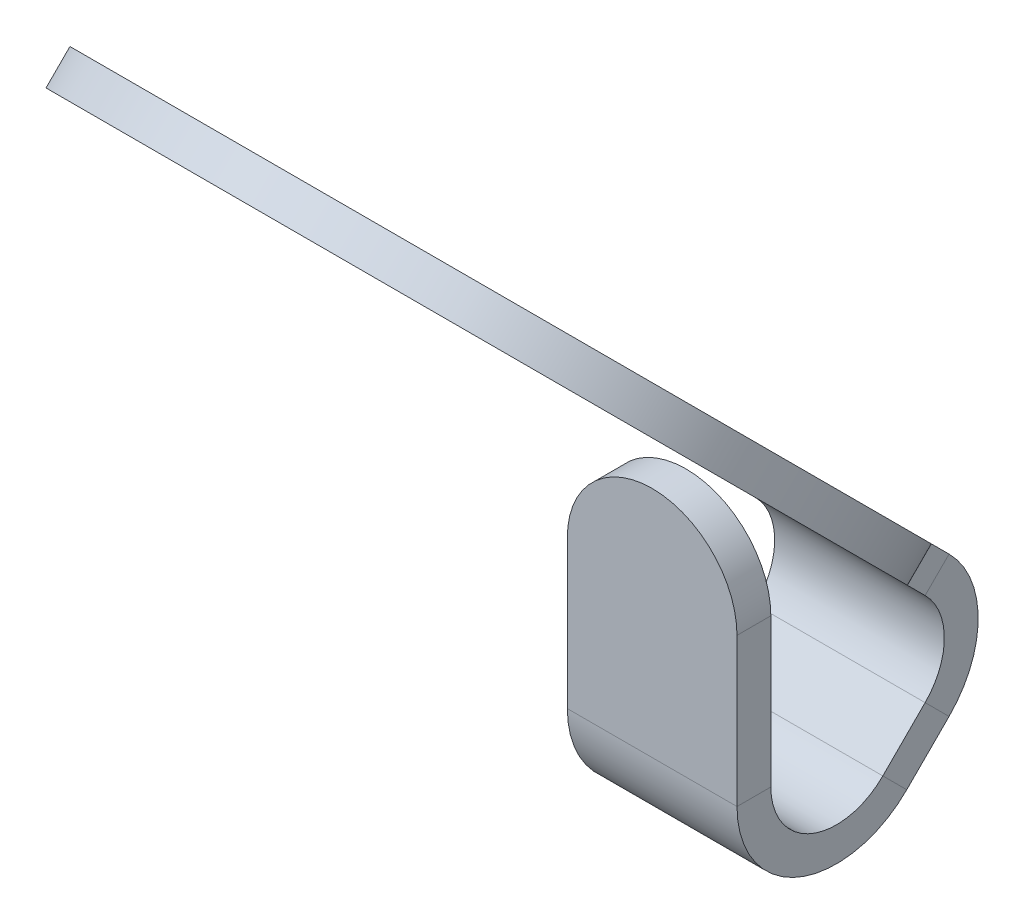
ISO-10303-21;
HEADER;
FILE_DESCRIPTION(('STEP AP214'),'2;1');
FILE_NAME('part.step','',(''),(''),'','','');
FILE_SCHEMA(('AUTOMOTIVE_DESIGN { 1 0 10303 214 1 1 1 1 }'));
ENDSEC;
DATA;
#1=APPLICATION_CONTEXT('core data for automotive mechanical design processes');
#2=APPLICATION_PROTOCOL_DEFINITION('international standard','automotive_design',2000,#1);
#3=PRODUCT_CONTEXT('',#1,'mechanical');
#4=PRODUCT('Part','Part','',(#3));
#5=PRODUCT_RELATED_PRODUCT_CATEGORY('part','',(#4));
#6=PRODUCT_DEFINITION_FORMATION('','',#4);
#7=PRODUCT_DEFINITION_CONTEXT('part definition',#1,'design');
#8=PRODUCT_DEFINITION('design','',#6,#7);
#9=PRODUCT_DEFINITION_SHAPE('','',#8);
#10=(LENGTH_UNIT() NAMED_UNIT(*) SI_UNIT(.MILLI.,.METRE.));
#11=(NAMED_UNIT(*) PLANE_ANGLE_UNIT() SI_UNIT($,.RADIAN.));
#12=(NAMED_UNIT(*) SI_UNIT($,.STERADIAN.) SOLID_ANGLE_UNIT());
#13=UNCERTAINTY_MEASURE_WITH_UNIT(LENGTH_MEASURE(1.E-05),#10,'distance_accuracy_value','');
#14=(GEOMETRIC_REPRESENTATION_CONTEXT(3) GLOBAL_UNCERTAINTY_ASSIGNED_CONTEXT((#13)) GLOBAL_UNIT_ASSIGNED_CONTEXT((#10,
#11,#12)) REPRESENTATION_CONTEXT('',''));
#15=CARTESIAN_POINT('',(0.,0.,0.));
#16=DIRECTION('',(0.,0.,1.));
#17=DIRECTION('',(1.,0.,0.));
#18=AXIS2_PLACEMENT_3D('',#15,#16,#17);
#19=CARTESIAN_POINT('',(0.9525,5.67722747838223,2.10753662697403));
#20=DIRECTION('',(1.,0.,0.));
#21=DIRECTION('',(0.,0.707106781186549,-0.707106781186546));
#22=AXIS2_PLACEMENT_3D('',#19,#20,#21);
#23=PLANE('',#22);
#24=DIRECTION('',(0.,0.707106781186549,-0.707106781186546));
#25=VECTOR('',#24,1.);
#26=CARTESIAN_POINT('',(0.9525,5.94592805523312,2.37623720382492));
#27=LINE('',#26,#25);
#28=CARTESIAN_POINT('',(0.952500000000001,3.07077005228413,5.2513952067739));
#29=VERTEX_POINT('',#28);
#30=CARTESIAN_POINT('',(0.9525,3.54578677576021,4.77637848329782));
#31=VERTEX_POINT('',#30);
#32=EDGE_CURVE('E164',#29,#31,#27,.T.);
#33=ORIENTED_EDGE('',*,*,#32,.F.);
#34=DIRECTION('',(0.,-0.707106781186544,-0.707106781186551));
#35=VECTOR('',#34,1.);
#36=CARTESIAN_POINT('',(0.952500000000001,2.80206947543323,4.982694629923));
#37=LINE('',#36,#35);
#38=CARTESIAN_POINT('',(0.952500000000001,2.80206947543324,4.98269462992301));
#39=VERTEX_POINT('',#38);
#40=EDGE_CURVE('E147',#29,#39,#37,.T.);
#41=ORIENTED_EDGE('',*,*,#40,.T.);
#42=DIRECTION('',(0.,0.707106781186549,-0.707106781186546));
#43=VECTOR('',#42,1.);
#44=CARTESIAN_POINT('',(0.9525,5.67722747838223,2.10753662697403));
#45=LINE('',#44,#43);
#46=CARTESIAN_POINT('',(0.952500000000001,3.27708619890932,4.50767790644693));
#47=VERTEX_POINT('',#46);
#48=EDGE_CURVE('E52',#39,#47,#45,.T.);
#49=ORIENTED_EDGE('',*,*,#48,.T.);
#50=DIRECTION('',(0.,0.707106781186546,0.707106781186549));
#51=VECTOR('',#50,1.);
#52=CARTESIAN_POINT('',(0.952500000000001,3.27708619890932,4.50767790644693));
#53=LINE('',#52,#51);
#54=EDGE_CURVE('E148',#47,#31,#53,.T.);
#55=ORIENTED_EDGE('',*,*,#54,.T.);
#56=EDGE_LOOP('',(#33,#41,#49,#55));
#57=FACE_BOUND('',#56,.T.);
#58=ADVANCED_FACE('F48',(#57),#23,.T.);
#59=CARTESIAN_POINT('',(-0.9525,5.67722747838223,2.10753662697403));
#60=DIRECTION('',(-1.,0.,0.));
#61=DIRECTION('',(0.,-0.707106781186549,0.707106781186546));
#62=AXIS2_PLACEMENT_3D('',#59,#60,#61);
#63=PLANE('',#62);
#64=DIRECTION('',(0.,-0.707106781186549,0.707106781186546));
#65=VECTOR('',#64,1.);
#66=CARTESIAN_POINT('',(-0.9525,5.67722747838223,2.10753662697403));
#67=LINE('',#66,#65);
#68=CARTESIAN_POINT('',(-0.952499999999999,3.27708619890932,4.50767790644693));
#69=VERTEX_POINT('',#68);
#70=CARTESIAN_POINT('',(-0.952499999999999,2.80206947543324,4.98269462992301));
#71=VERTEX_POINT('',#70);
#72=EDGE_CURVE('E162',#69,#71,#67,.T.);
#73=ORIENTED_EDGE('',*,*,#72,.T.);
#74=DIRECTION('',(0.,0.707106781186544,0.707106781186551));
#75=VECTOR('',#74,1.);
#76=CARTESIAN_POINT('',(-0.952499999999999,2.80206947543323,4.982694629923));
#77=LINE('',#76,#75);
#78=CARTESIAN_POINT('',(-0.952499999999999,3.07077005228413,5.2513952067739));
#79=VERTEX_POINT('',#78);
#80=EDGE_CURVE('E12',#71,#79,#77,.T.);
#81=ORIENTED_EDGE('',*,*,#80,.T.);
#82=DIRECTION('',(0.,-0.707106781186549,0.707106781186546));
#83=VECTOR('',#82,1.);
#84=CARTESIAN_POINT('',(-0.9525,5.94592805523312,2.37623720382492));
#85=LINE('',#84,#83);
#86=CARTESIAN_POINT('',(-0.952499999999999,3.54578677576021,4.77637848329782));
#87=VERTEX_POINT('',#86);
#88=EDGE_CURVE('E171',#87,#79,#85,.T.);
#89=ORIENTED_EDGE('',*,*,#88,.F.);
#90=DIRECTION('',(0.,-0.707106781186546,-0.707106781186549));
#91=VECTOR('',#90,1.);
#92=CARTESIAN_POINT('',(-0.9525,3.27708619890932,4.50767790644693));
#93=LINE('',#92,#91);
#94=EDGE_CURVE('E189',#87,#69,#93,.T.);
#95=ORIENTED_EDGE('',*,*,#94,.T.);
#96=EDGE_LOOP('',(#73,#81,#89,#95));
#97=FACE_BOUND('',#96,.T.);
#98=ADVANCED_FACE('F50',(#97),#63,.T.);
#99=CARTESIAN_POINT('',(0.,8.38787719293408,-0.603113087577814));
#100=DIRECTION('',(0.,-0.707106781186546,-0.707106781186549));
#101=DIRECTION('',(0.,0.707106781186549,-0.707106781186546));
#102=AXIS2_PLACEMENT_3D('',#99,#100,#101);
#103=PLANE('',#102);
#104=ORIENTED_EDGE('',*,*,#48,.F.);
#105=DIRECTION('',(-1.,0.,0.));
#106=VECTOR('',#105,1.);
#107=CARTESIAN_POINT('',(0.,2.80206947543324,4.98269462992301));
#108=LINE('',#107,#106);
#109=EDGE_CURVE('E140',#39,#71,#108,.T.);
#110=ORIENTED_EDGE('',*,*,#109,.T.);
#111=ORIENTED_EDGE('',*,*,#72,.F.);
#112=DIRECTION('',(1.,0.,0.));
#113=VECTOR('',#112,1.);
#114=CARTESIAN_POINT('',(0.,3.27708619890932,4.50767790644693));
#115=LINE('',#114,#113);
#116=EDGE_CURVE('E161',#69,#47,#115,.T.);
#117=ORIENTED_EDGE('',*,*,#116,.T.);
#118=EDGE_LOOP('',(#104,#110,#111,#117));
#119=FACE_BOUND('',#118,.T.);
#120=ADVANCED_FACE('F160',(#119),#103,.T.);
#121=CARTESIAN_POINT('',(0.,8.65657776978497,-0.334412510726924));
#122=DIRECTION('',(0.,-0.707106781186546,-0.707106781186549));
#123=DIRECTION('',(0.,0.707106781186549,-0.707106781186546));
#124=AXIS2_PLACEMENT_3D('',#121,#122,#123);
#125=PLANE('',#124);
#126=DIRECTION('',(-1.,0.,0.));
#127=VECTOR('',#126,1.);
#128=CARTESIAN_POINT('',(0.,3.07077005228412,5.2513952067739));
#129=LINE('',#128,#127);
#130=EDGE_CURVE('E57',#29,#79,#129,.T.);
#131=ORIENTED_EDGE('',*,*,#130,.F.);
#132=ORIENTED_EDGE('',*,*,#32,.T.);
#133=DIRECTION('',(1.,0.,0.));
#134=VECTOR('',#133,1.);
#135=CARTESIAN_POINT('',(0.,3.54578677576021,4.77637848329782));
#136=LINE('',#135,#134);
#137=EDGE_CURVE('E178',#87,#31,#136,.T.);
#138=ORIENTED_EDGE('',*,*,#137,.F.);
#139=ORIENTED_EDGE('',*,*,#88,.T.);
#140=EDGE_LOOP('',(#131,#132,#138,#139));
#141=FACE_BOUND('',#140,.T.);
#142=ADVANCED_FACE('F177',(#141),#125,.F.);
#143=CARTESIAN_POINT('',(0.,8.93779422405546,8.58927506784732));
#144=DIRECTION('',(0.,-0.707106781186551,0.707106781186544));
#145=DIRECTION('',(0.,-0.707106781186544,-0.707106781186551));
#146=AXIS2_PLACEMENT_3D('',#143,#144,#145);
#147=CYLINDRICAL_SURFACE('',#146,1.65);
#148=CARTESIAN_POINT('',(0.,8.93779422405546,8.58927506784732));
#149=DIRECTION('',(0.,-0.707106781186551,0.707106781186544));
#150=DIRECTION('',(0.,-0.707106781186544,-0.707106781186551));
#151=AXIS2_PLACEMENT_3D('',#148,#149,#150);
#152=CIRCLE('',#151,1.65);
#153=CARTESIAN_POINT('',(0.,7.77106803509766,7.42254887888951));
#154=VERTEX_POINT('',#153);
#155=EDGE_CURVE('E220',#154,#154,#152,.T.);
#156=ORIENTED_EDGE('',*,*,#155,.F.);
#157=EDGE_LOOP('',(#156));
#158=FACE_BOUND('',#157,.T.);
#159=CARTESIAN_POINT('',(0.,8.66909364720457,8.85797564469821));
#160=DIRECTION('',(0.,-0.707106781186551,0.707106781186544));
#161=DIRECTION('',(0.,-0.707106781186544,-0.707106781186551));
#162=AXIS2_PLACEMENT_3D('',#159,#160,#161);
#163=CIRCLE('',#162,1.65);
#164=CARTESIAN_POINT('',(0.,7.50236745824678,7.6912494557404));
#165=VERTEX_POINT('',#164);
#166=EDGE_CURVE('E212',#165,#165,#163,.T.);
#167=ORIENTED_EDGE('',*,*,#166,.T.);
#168=EDGE_LOOP('',(#167));
#169=FACE_BOUND('',#168,.T.);
#170=ADVANCED_FACE('F315',(#158,#169),#147,.F.);
#171=CARTESIAN_POINT('',(0.,8.93779422405546,8.58927506784732));
#172=DIRECTION('',(0.,-0.707106781186551,0.707106781186544));
#173=DIRECTION('',(0.,-0.707106781186544,-0.707106781186551));
#174=AXIS2_PLACEMENT_3D('',#171,#172,#173);
#175=CYLINDRICAL_SURFACE('',#174,3.95);
#176=CARTESIAN_POINT('',(0.,8.66909364720457,8.85797564469821));
#177=DIRECTION('',(0.,-0.707106781186551,0.707106781186544));
#178=DIRECTION('',(0.,0.707106781186544,0.707106781186551));
#179=AXIS2_PLACEMENT_3D('',#176,#177,#178);
#180=CIRCLE('',#179,3.95);
#181=CARTESIAN_POINT('',(0.9525,5.95844393265274,6.14732593014635));
#182=VERTEX_POINT('',#181);
#183=CARTESIAN_POINT('',(-0.9525,5.95844393265274,6.14732593014635));
#184=VERTEX_POINT('',#183);
#185=EDGE_CURVE('E232',#182,#184,#180,.T.);
#186=ORIENTED_EDGE('',*,*,#185,.F.);
#187=DIRECTION('',(0.,-0.707106781186551,0.707106781186544));
#188=VECTOR('',#187,1.);
#189=CARTESIAN_POINT('',(0.9525,6.22714450950363,5.87862535329546));
#190=LINE('',#189,#188);
#191=CARTESIAN_POINT('',(0.9525,6.22714450950363,5.87862535329546));
#192=VERTEX_POINT('',#191);
#193=EDGE_CURVE('E173',#192,#182,#190,.T.);
#194=ORIENTED_EDGE('',*,*,#193,.F.);
#195=CARTESIAN_POINT('',(0.,8.93779422405546,8.58927506784732));
#196=DIRECTION('',(0.,-0.707106781186551,0.707106781186544));
#197=DIRECTION('',(0.,0.707106781186544,0.707106781186551));
#198=AXIS2_PLACEMENT_3D('',#195,#196,#197);
#199=CIRCLE('',#198,3.95);
#200=CARTESIAN_POINT('',(-0.9525,6.22714450950363,5.87862535329546));
#201=VERTEX_POINT('',#200);
#202=EDGE_CURVE('E215',#192,#201,#199,.T.);
#203=ORIENTED_EDGE('',*,*,#202,.T.);
#204=DIRECTION('',(0.,-0.707106781186551,0.707106781186544));
#205=VECTOR('',#204,1.);
#206=CARTESIAN_POINT('',(-0.9525,6.22714450950363,5.87862535329546));
#207=LINE('',#206,#205);
#208=EDGE_CURVE('E218',#201,#184,#207,.T.);
#209=ORIENTED_EDGE('',*,*,#208,.T.);
#210=EDGE_LOOP('',(#186,#194,#203,#209));
#211=FACE_BOUND('',#210,.T.);
#212=ADVANCED_FACE('F320',(#211),#175,.T.);
#213=CARTESIAN_POINT('',(0.,8.93779422405546,8.58927506784732));
#214=DIRECTION('',(0.,0.707106781186551,-0.707106781186544));
#215=DIRECTION('',(0.,0.707106781186544,0.707106781186551));
#216=AXIS2_PLACEMENT_3D('',#213,#214,#215);
#217=PLANE('',#216);
#218=DIRECTION('',(1.,0.,0.));
#219=VECTOR('',#218,1.);
#220=CARTESIAN_POINT('',(0.,4.85619706265512,4.50767790644694));
#221=LINE('',#220,#219);
#222=CARTESIAN_POINT('',(-0.9525,4.85619706265512,4.50767790644694));
#223=VERTEX_POINT('',#222);
#224=CARTESIAN_POINT('',(0.9525,4.85619706265512,4.50767790644694));
#225=VERTEX_POINT('',#224);
#226=EDGE_CURVE('E204',#223,#225,#221,.T.);
#227=ORIENTED_EDGE('',*,*,#226,.F.);
#228=DIRECTION('',(0.,-0.707106781186544,-0.707106781186551));
#229=VECTOR('',#228,1.);
#230=CARTESIAN_POINT('',(-0.9525,6.22714450950363,5.87862535329546));
#231=LINE('',#230,#229);
#232=EDGE_CURVE('E223',#201,#223,#231,.T.);
#233=ORIENTED_EDGE('',*,*,#232,.F.);
#234=ORIENTED_EDGE('',*,*,#202,.F.);
#235=DIRECTION('',(0.,0.707106781186544,0.707106781186551));
#236=VECTOR('',#235,1.);
#237=CARTESIAN_POINT('',(0.9525,6.22714450950363,5.87862535329546));
#238=LINE('',#237,#236);
#239=EDGE_CURVE('E235',#225,#192,#238,.T.);
#240=ORIENTED_EDGE('',*,*,#239,.F.);
#241=EDGE_LOOP('',(#227,#233,#234,#240));
#242=FACE_BOUND('',#241,.T.);
#243=ORIENTED_EDGE('',*,*,#155,.T.);
#244=EDGE_LOOP('',(#243));
#245=FACE_BOUND('',#244,.T.);
#246=ADVANCED_FACE('F445',(#242,#245),#217,.T.);
#247=CARTESIAN_POINT('',(-0.9525,6.22714450950363,5.87862535329546));
#248=DIRECTION('',(-1.,0.,0.));
#249=DIRECTION('',(0.,-0.707106781186544,-0.707106781186551));
#250=AXIS2_PLACEMENT_3D('',#247,#248,#249);
#251=PLANE('',#250);
#252=DIRECTION('',(0.,0.707106781186551,-0.707106781186544));
#253=VECTOR('',#252,1.);
#254=CARTESIAN_POINT('',(-0.9525,4.85619706265512,4.50767790644694));
#255=LINE('',#254,#253);
#256=CARTESIAN_POINT('',(-0.9525,4.58749648580423,4.77637848329782));
#257=VERTEX_POINT('',#256);
#258=EDGE_CURVE('E209',#257,#223,#255,.T.);
#259=ORIENTED_EDGE('',*,*,#258,.F.);
#260=DIRECTION('',(0.,-0.707106781186544,-0.707106781186551));
#261=VECTOR('',#260,1.);
#262=CARTESIAN_POINT('',(-0.9525,5.95844393265274,6.14732593014635));
#263=LINE('',#262,#261);
#264=EDGE_CURVE('E225',#184,#257,#263,.T.);
#265=ORIENTED_EDGE('',*,*,#264,.F.);
#266=ORIENTED_EDGE('',*,*,#208,.F.);
#267=ORIENTED_EDGE('',*,*,#232,.T.);
#268=EDGE_LOOP('',(#259,#265,#266,#267));
#269=FACE_BOUND('',#268,.T.);
#270=ADVANCED_FACE('F456',(#269),#251,.T.);
#271=CARTESIAN_POINT('',(0.,8.66909364720457,8.85797564469821));
#272=DIRECTION('',(0.,0.707106781186551,-0.707106781186544));
#273=DIRECTION('',(0.,0.707106781186544,0.707106781186551));
#274=AXIS2_PLACEMENT_3D('',#271,#272,#273);
#275=PLANE('',#274);
#276=ORIENTED_EDGE('',*,*,#166,.F.);
#277=EDGE_LOOP('',(#276));
#278=FACE_BOUND('',#277,.T.);
#279=ORIENTED_EDGE('',*,*,#264,.T.);
#280=DIRECTION('',(1.,0.,0.));
#281=VECTOR('',#280,1.);
#282=CARTESIAN_POINT('',(0.,4.58749648580423,4.77637848329782));
#283=LINE('',#282,#281);
#284=CARTESIAN_POINT('',(0.9525,4.58749648580423,4.77637848329782));
#285=VERTEX_POINT('',#284);
#286=EDGE_CURVE('E227',#257,#285,#283,.T.);
#287=ORIENTED_EDGE('',*,*,#286,.T.);
#288=DIRECTION('',(0.,0.707106781186544,0.707106781186551));
#289=VECTOR('',#288,1.);
#290=CARTESIAN_POINT('',(0.9525,5.95844393265274,6.14732593014635));
#291=LINE('',#290,#289);
#292=EDGE_CURVE('E230',#285,#182,#291,.T.);
#293=ORIENTED_EDGE('',*,*,#292,.T.);
#294=ORIENTED_EDGE('',*,*,#185,.T.);
#295=EDGE_LOOP('',(#279,#287,#293,#294));
#296=FACE_BOUND('',#295,.T.);
#297=ADVANCED_FACE('F467',(#278,#296),#275,.F.);
#298=CARTESIAN_POINT('',(0.9525,6.22714450950363,5.87862535329546));
#299=DIRECTION('',(1.,0.,0.));
#300=DIRECTION('',(0.,0.707106781186544,0.707106781186551));
#301=AXIS2_PLACEMENT_3D('',#298,#299,#300);
#302=PLANE('',#301);
#303=DIRECTION('',(0.,-0.707106781186551,0.707106781186544));
#304=VECTOR('',#303,1.);
#305=CARTESIAN_POINT('',(0.9525,4.85619706265512,4.50767790644694));
#306=LINE('',#305,#304);
#307=EDGE_CURVE('E197',#225,#285,#306,.T.);
#308=ORIENTED_EDGE('',*,*,#307,.F.);
#309=ORIENTED_EDGE('',*,*,#239,.T.);
#310=ORIENTED_EDGE('',*,*,#193,.T.);
#311=ORIENTED_EDGE('',*,*,#292,.F.);
#312=EDGE_LOOP('',(#308,#309,#310,#311));
#313=FACE_BOUND('',#312,.T.);
#314=ADVANCED_FACE('F479',(#313),#302,.T.);
#315=CARTESIAN_POINT('',(-0.9525,4.06664163078222,5.29723333831983));
#316=DIRECTION('',(-1.,0.,0.));
#317=DIRECTION('',(0.,-0.707106781186544,-0.707106781186551));
#318=AXIS2_PLACEMENT_3D('',#315,#316,#317);
#319=PLANE('',#318);
#320=ORIENTED_EDGE('',*,*,#94,.F.);
#321=CARTESIAN_POINT('',(-0.952499999999999,4.06664163078222,5.29723333831983));
#322=DIRECTION('',(-1.,0.,0.));
#323=DIRECTION('',(0.,-0.707106781186544,-0.707106781186551));
#324=AXIS2_PLACEMENT_3D('',#321,#322,#323);
#325=CIRCLE('',#324,0.7366);
#326=EDGE_CURVE('E187',#87,#257,#325,.F.);
#327=ORIENTED_EDGE('',*,*,#326,.T.);
#328=ORIENTED_EDGE('',*,*,#258,.T.);
#329=CARTESIAN_POINT('',(-0.9525,4.06664163078222,5.29723333831983));
#330=DIRECTION('',(1.,0.,0.));
#331=DIRECTION('',(0.,-0.707106781186544,-0.707106781186551));
#332=AXIS2_PLACEMENT_3D('',#329,#330,#331);
#333=CIRCLE('',#332,1.1166);
#334=EDGE_CURVE('E198',#69,#223,#333,.T.);
#335=ORIENTED_EDGE('',*,*,#334,.F.);
#336=EDGE_LOOP('',(#320,#327,#328,#335));
#337=FACE_BOUND('',#336,.T.);
#338=ADVANCED_FACE('F489',(#337),#319,.T.);
#339=CARTESIAN_POINT('',(0.952500000000001,4.06664163078222,5.29723333831983));
#340=DIRECTION('',(1.,0.,0.));
#341=DIRECTION('',(0.,0.707106781186544,0.707106781186551));
#342=AXIS2_PLACEMENT_3D('',#339,#340,#341);
#343=PLANE('',#342);
#344=CARTESIAN_POINT('',(0.9525,4.06664163078222,5.29723333831983));
#345=DIRECTION('',(-1.,0.,0.));
#346=DIRECTION('',(0.,-0.707106781186544,-0.707106781186551));
#347=AXIS2_PLACEMENT_3D('',#344,#345,#346);
#348=CIRCLE('',#347,0.7366);
#349=EDGE_CURVE('E185',#285,#31,#348,.T.);
#350=ORIENTED_EDGE('',*,*,#349,.T.);
#351=ORIENTED_EDGE('',*,*,#54,.F.);
#352=CARTESIAN_POINT('',(0.952500000000001,4.06664163078222,5.29723333831983));
#353=DIRECTION('',(-1.,0.,0.));
#354=DIRECTION('',(0.,0.707106781186544,0.707106781186551));
#355=AXIS2_PLACEMENT_3D('',#352,#353,#354);
#356=CIRCLE('',#355,1.1166);
#357=EDGE_CURVE('E207',#225,#47,#356,.T.);
#358=ORIENTED_EDGE('',*,*,#357,.F.);
#359=ORIENTED_EDGE('',*,*,#307,.T.);
#360=EDGE_LOOP('',(#350,#351,#358,#359));
#361=FACE_BOUND('',#360,.T.);
#362=ADVANCED_FACE('F194',(#361),#343,.T.);
#363=CARTESIAN_POINT('',(2.42732463634845,4.06664163078222,5.29723333831983));
#364=DIRECTION('',(-1.,0.,0.));
#365=DIRECTION('',(0.,-0.707106781186544,-0.707106781186551));
#366=AXIS2_PLACEMENT_3D('',#363,#364,#365);
#367=CYLINDRICAL_SURFACE('',#366,1.1166);
#368=ORIENTED_EDGE('',*,*,#226,.T.);
#369=ORIENTED_EDGE('',*,*,#357,.T.);
#370=ORIENTED_EDGE('',*,*,#116,.F.);
#371=ORIENTED_EDGE('',*,*,#334,.T.);
#372=EDGE_LOOP('',(#368,#369,#370,#371));
#373=FACE_BOUND('',#372,.T.);
#374=ADVANCED_FACE('F508',(#373),#367,.T.);
#375=CARTESIAN_POINT('',(2.42732463634845,4.06664163078222,5.29723333831983));
#376=DIRECTION('',(-1.,0.,0.));
#377=DIRECTION('',(0.,-0.707106781186544,-0.707106781186551));
#378=AXIS2_PLACEMENT_3D('',#375,#376,#377);
#379=CYLINDRICAL_SURFACE('',#378,0.7366);
#380=ORIENTED_EDGE('',*,*,#286,.F.);
#381=ORIENTED_EDGE('',*,*,#326,.F.);
#382=ORIENTED_EDGE('',*,*,#137,.T.);
#383=ORIENTED_EDGE('',*,*,#349,.F.);
#384=EDGE_LOOP('',(#380,#381,#382,#383));
#385=FACE_BOUND('',#384,.T.);
#386=ADVANCED_FACE('F184',(#385),#379,.F.);
#387=CARTESIAN_POINT('',(0.,5.25635006179592,6.88885006179591));
#388=DIRECTION('',(0.,0.,-1.));
#389=DIRECTION('',(0.,1.,0.));
#390=AXIS2_PLACEMENT_3D('',#387,#388,#389);
#391=CYLINDRICAL_SURFACE('',#390,0.9525);
#392=CARTESIAN_POINT('',(0.,5.25635006179592,6.50885006179591));
#393=DIRECTION('',(0.,0.,-1.));
#394=DIRECTION('',(0.,-1.,0.));
#395=AXIS2_PLACEMENT_3D('',#392,#393,#394);
#396=CIRCLE('',#395,0.9525);
#397=CARTESIAN_POINT('',(-0.952499999999999,5.25635006179592,6.50885006179591));
#398=VERTEX_POINT('',#397);
#399=CARTESIAN_POINT('',(0.952500000000001,5.25635006179592,6.50885006179591));
#400=VERTEX_POINT('',#399);
#401=EDGE_CURVE('E264',#398,#400,#396,.T.);
#402=ORIENTED_EDGE('',*,*,#401,.F.);
#403=DIRECTION('',(0.,0.,-1.));
#404=VECTOR('',#403,1.);
#405=CARTESIAN_POINT('',(-0.952499999999999,5.25635006179592,6.88885006179591));
#406=LINE('',#405,#404);
#407=CARTESIAN_POINT('',(-0.952499999999999,5.25635006179592,6.88885006179591));
#408=VERTEX_POINT('',#407);
#409=EDGE_CURVE('E240',#408,#398,#406,.T.);
#410=ORIENTED_EDGE('',*,*,#409,.F.);
#411=CARTESIAN_POINT('',(0.,5.25635006179592,6.88885006179591));
#412=DIRECTION('',(0.,0.,-1.));
#413=DIRECTION('',(0.,-1.,0.));
#414=AXIS2_PLACEMENT_3D('',#411,#412,#413);
#415=CIRCLE('',#414,0.9525);
#416=CARTESIAN_POINT('',(0.952500000000001,5.25635006179592,6.88885006179591));
#417=VERTEX_POINT('',#416);
#418=EDGE_CURVE('E250',#408,#417,#415,.T.);
#419=ORIENTED_EDGE('',*,*,#418,.T.);
#420=DIRECTION('',(0.,0.,-1.));
#421=VECTOR('',#420,1.);
#422=CARTESIAN_POINT('',(0.952500000000001,5.25635006179592,6.88885006179591));
#423=LINE('',#422,#421);
#424=EDGE_CURVE('E253',#417,#400,#423,.T.);
#425=ORIENTED_EDGE('',*,*,#424,.T.);
#426=EDGE_LOOP('',(#402,#410,#419,#425));
#427=FACE_BOUND('',#426,.T.);
#428=ADVANCED_FACE('F295',(#427),#391,.T.);
#429=CARTESIAN_POINT('',(0.,-6.49114993820407,6.88885006179595));
#430=DIRECTION('',(0.,0.,1.));
#431=DIRECTION('',(0.,-1.,0.));
#432=AXIS2_PLACEMENT_3D('',#429,#430,#431);
#433=PLANE('',#432);
#434=DIRECTION('',(-1.,0.,0.));
#435=VECTOR('',#434,1.);
#436=CARTESIAN_POINT('',(0.,3.59162490730614,6.88885006179591));
#437=LINE('',#436,#435);
#438=CARTESIAN_POINT('',(0.952500000000001,3.59162490730614,6.88885006179591));
#439=VERTEX_POINT('',#438);
#440=CARTESIAN_POINT('',(-0.952499999999999,3.59162490730614,6.88885006179591));
#441=VERTEX_POINT('',#440);
#442=EDGE_CURVE('E244',#439,#441,#437,.T.);
#443=ORIENTED_EDGE('',*,*,#442,.F.);
#444=DIRECTION('',(0.,-1.,0.));
#445=VECTOR('',#444,1.);
#446=CARTESIAN_POINT('',(0.9525,-2.6577123490421,6.88885006179593));
#447=LINE('',#446,#445);
#448=EDGE_CURVE('E255',#417,#439,#447,.T.);
#449=ORIENTED_EDGE('',*,*,#448,.F.);
#450=ORIENTED_EDGE('',*,*,#418,.F.);
#451=DIRECTION('',(0.,1.,0.));
#452=VECTOR('',#451,1.);
#453=CARTESIAN_POINT('',(-0.9525,-2.6577123490421,6.88885006179593));
#454=LINE('',#453,#452);
#455=EDGE_CURVE('E267',#441,#408,#454,.T.);
#456=ORIENTED_EDGE('',*,*,#455,.F.);
#457=EDGE_LOOP('',(#443,#449,#450,#456));
#458=FACE_BOUND('',#457,.T.);
#459=ADVANCED_FACE('F291',(#458),#433,.T.);
#460=CARTESIAN_POINT('',(0.9525,-2.6577123490421,6.88885006179593));
#461=DIRECTION('',(1.,0.,0.));
#462=DIRECTION('',(0.,-1.,0.));
#463=AXIS2_PLACEMENT_3D('',#460,#461,#462);
#464=PLANE('',#463);
#465=DIRECTION('',(0.,0.,1.));
#466=VECTOR('',#465,1.);
#467=CARTESIAN_POINT('',(0.952500000000001,3.59162490730614,6.88885006179593));
#468=LINE('',#467,#466);
#469=CARTESIAN_POINT('',(0.952500000000001,3.59162490730614,6.50885006179591));
#470=VERTEX_POINT('',#469);
#471=EDGE_CURVE('E156',#470,#439,#468,.T.);
#472=ORIENTED_EDGE('',*,*,#471,.F.);
#473=DIRECTION('',(0.,-1.,0.));
#474=VECTOR('',#473,1.);
#475=CARTESIAN_POINT('',(0.9525,-2.6577123490421,6.50885006179593));
#476=LINE('',#475,#474);
#477=EDGE_CURVE('E257',#400,#470,#476,.T.);
#478=ORIENTED_EDGE('',*,*,#477,.F.);
#479=ORIENTED_EDGE('',*,*,#424,.F.);
#480=ORIENTED_EDGE('',*,*,#448,.T.);
#481=EDGE_LOOP('',(#472,#478,#479,#480));
#482=FACE_BOUND('',#481,.T.);
#483=ADVANCED_FACE('F297',(#482),#464,.T.);
#484=CARTESIAN_POINT('',(0.,-6.49114993820408,6.50885006179595));
#485=DIRECTION('',(0.,0.,1.));
#486=DIRECTION('',(0.,-1.,0.));
#487=AXIS2_PLACEMENT_3D('',#484,#485,#486);
#488=PLANE('',#487);
#489=ORIENTED_EDGE('',*,*,#477,.T.);
#490=DIRECTION('',(-1.,0.,0.));
#491=VECTOR('',#490,1.);
#492=CARTESIAN_POINT('',(0.,3.59162490730614,6.50885006179591));
#493=LINE('',#492,#491);
#494=CARTESIAN_POINT('',(-0.952499999999999,3.59162490730614,6.50885006179591));
#495=VERTEX_POINT('',#494);
#496=EDGE_CURVE('E259',#470,#495,#493,.T.);
#497=ORIENTED_EDGE('',*,*,#496,.T.);
#498=DIRECTION('',(0.,1.,0.));
#499=VECTOR('',#498,1.);
#500=CARTESIAN_POINT('',(-0.9525,-2.6577123490421,6.50885006179593));
#501=LINE('',#500,#499);
#502=EDGE_CURVE('E262',#495,#398,#501,.T.);
#503=ORIENTED_EDGE('',*,*,#502,.T.);
#504=ORIENTED_EDGE('',*,*,#401,.T.);
#505=EDGE_LOOP('',(#489,#497,#503,#504));
#506=FACE_BOUND('',#505,.T.);
#507=ADVANCED_FACE('F280',(#506),#488,.F.);
#508=CARTESIAN_POINT('',(-0.9525,-2.6577123490421,6.88885006179593));
#509=DIRECTION('',(-1.,0.,0.));
#510=DIRECTION('',(0.,1.,0.));
#511=AXIS2_PLACEMENT_3D('',#508,#509,#510);
#512=PLANE('',#511);
#513=DIRECTION('',(0.,0.,-1.));
#514=VECTOR('',#513,1.);
#515=CARTESIAN_POINT('',(-0.952499999999999,3.59162490730614,6.88885006179593));
#516=LINE('',#515,#514);
#517=EDGE_CURVE('E246',#441,#495,#516,.T.);
#518=ORIENTED_EDGE('',*,*,#517,.F.);
#519=ORIENTED_EDGE('',*,*,#455,.T.);
#520=ORIENTED_EDGE('',*,*,#409,.T.);
#521=ORIENTED_EDGE('',*,*,#502,.F.);
#522=EDGE_LOOP('',(#518,#519,#520,#521));
#523=FACE_BOUND('',#522,.T.);
#524=ADVANCED_FACE('F286',(#523),#512,.T.);
#525=CARTESIAN_POINT('',(0.952500000000001,3.59162490730614,5.77225006179591));
#526=DIRECTION('',(1.,0.,0.));
#527=DIRECTION('',(0.,0.,-1.));
#528=AXIS2_PLACEMENT_3D('',#525,#526,#527);
#529=PLANE('',#528);
#530=ORIENTED_EDGE('',*,*,#40,.F.);
#531=CARTESIAN_POINT('',(0.952500000000001,3.59162490730614,5.77225006179591));
#532=DIRECTION('',(1.,0.,0.));
#533=DIRECTION('',(0.,0.,-1.));
#534=AXIS2_PLACEMENT_3D('',#531,#532,#533);
#535=CIRCLE('',#534,0.7366);
#536=EDGE_CURVE('E273',#29,#470,#535,.F.);
#537=ORIENTED_EDGE('',*,*,#536,.T.);
#538=ORIENTED_EDGE('',*,*,#471,.T.);
#539=CARTESIAN_POINT('',(0.952500000000001,3.59162490730614,5.77225006179591));
#540=DIRECTION('',(-1.,0.,0.));
#541=DIRECTION('',(0.,0.,-1.));
#542=AXIS2_PLACEMENT_3D('',#539,#540,#541);
#543=CIRCLE('',#542,1.1166);
#544=EDGE_CURVE('E143',#39,#439,#543,.T.);
#545=ORIENTED_EDGE('',*,*,#544,.F.);
#546=EDGE_LOOP('',(#530,#537,#538,#545));
#547=FACE_BOUND('',#546,.T.);
#548=ADVANCED_FACE('F152',(#547),#529,.T.);
#549=CARTESIAN_POINT('',(-0.952499999999999,3.59162490730614,5.77225006179591));
#550=DIRECTION('',(-1.,0.,0.));
#551=DIRECTION('',(0.,0.,1.));
#552=AXIS2_PLACEMENT_3D('',#549,#550,#551);
#553=PLANE('',#552);
#554=CARTESIAN_POINT('',(-0.952499999999999,3.59162490730614,5.77225006179591));
#555=DIRECTION('',(1.,0.,0.));
#556=DIRECTION('',(0.,0.,-1.));
#557=AXIS2_PLACEMENT_3D('',#554,#555,#556);
#558=CIRCLE('',#557,0.7366);
#559=EDGE_CURVE('E157',#495,#79,#558,.T.);
#560=ORIENTED_EDGE('',*,*,#559,.T.);
#561=ORIENTED_EDGE('',*,*,#80,.F.);
#562=CARTESIAN_POINT('',(-0.952499999999999,3.59162490730614,5.77225006179591));
#563=DIRECTION('',(1.,0.,0.));
#564=DIRECTION('',(0.,0.,1.));
#565=AXIS2_PLACEMENT_3D('',#562,#563,#564);
#566=CIRCLE('',#565,1.1166);
#567=EDGE_CURVE('E65',#441,#71,#566,.T.);
#568=ORIENTED_EDGE('',*,*,#567,.F.);
#569=ORIENTED_EDGE('',*,*,#517,.T.);
#570=EDGE_LOOP('',(#560,#561,#568,#569));
#571=FACE_BOUND('',#570,.T.);
#572=ADVANCED_FACE('F284',(#571),#553,.T.);
#573=CARTESIAN_POINT('',(-2.92232865246268,3.59162490730614,5.77225006179591));
#574=DIRECTION('',(1.,0.,0.));
#575=DIRECTION('',(0.,0.,-1.));
#576=AXIS2_PLACEMENT_3D('',#573,#574,#575);
#577=CYLINDRICAL_SURFACE('',#576,1.1166);
#578=ORIENTED_EDGE('',*,*,#442,.T.);
#579=ORIENTED_EDGE('',*,*,#567,.T.);
#580=ORIENTED_EDGE('',*,*,#109,.F.);
#581=ORIENTED_EDGE('',*,*,#544,.T.);
#582=EDGE_LOOP('',(#578,#579,#580,#581));
#583=FACE_BOUND('',#582,.T.);
#584=ADVANCED_FACE('F142',(#583),#577,.T.);
#585=CARTESIAN_POINT('',(-2.92232865246268,3.59162490730614,5.77225006179591));
#586=DIRECTION('',(1.,0.,0.));
#587=DIRECTION('',(0.,0.,-1.));
#588=AXIS2_PLACEMENT_3D('',#585,#586,#587);
#589=CYLINDRICAL_SURFACE('',#588,0.7366);
#590=ORIENTED_EDGE('',*,*,#496,.F.);
#591=ORIENTED_EDGE('',*,*,#536,.F.);
#592=ORIENTED_EDGE('',*,*,#130,.T.);
#593=ORIENTED_EDGE('',*,*,#559,.F.);
#594=EDGE_LOOP('',(#590,#591,#592,#593));
#595=FACE_BOUND('',#594,.T.);
#596=ADVANCED_FACE('F277',(#595),#589,.F.);
#597=CLOSED_SHELL('',(#58,#98,#120,#142,#170,#212,#246,#270,#297,#314,#338,#362,#374,#386,#428,
#459,#483,#507,#524,#548,#572,#584,#596));
#598=MANIFOLD_SOLID_BREP('B2',#597);
#599=ADVANCED_BREP_SHAPE_REPRESENTATION('',(#18,#598),#14);
#600=SHAPE_DEFINITION_REPRESENTATION(#9,#599);
ENDSEC;
END-ISO-10303-21;
